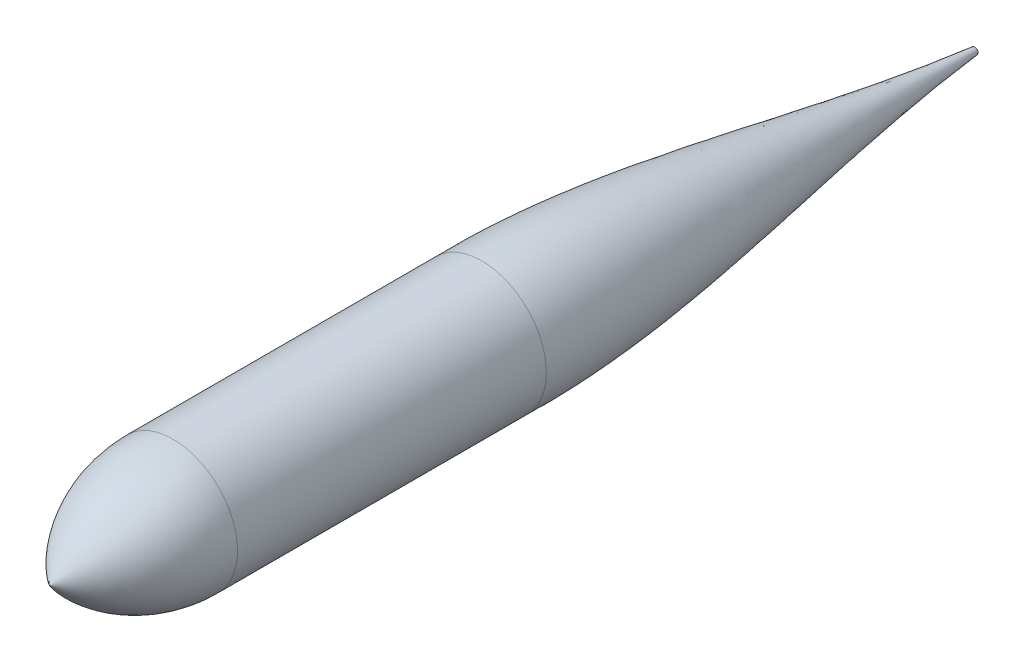
ISO-10303-21;
HEADER;
FILE_DESCRIPTION(('STEP AP214'),'2;1');
FILE_NAME('part.step','',(''),(''),'','','');
FILE_SCHEMA(('AUTOMOTIVE_DESIGN { 1 0 10303 214 1 1 1 1 }'));
ENDSEC;
DATA;
#1=APPLICATION_CONTEXT('core data for automotive mechanical design processes');
#2=APPLICATION_PROTOCOL_DEFINITION('international standard','automotive_design',2000,#1);
#3=PRODUCT_CONTEXT('',#1,'mechanical');
#4=PRODUCT('Part','Part','',(#3));
#5=PRODUCT_RELATED_PRODUCT_CATEGORY('part','',(#4));
#6=PRODUCT_DEFINITION_FORMATION('','',#4);
#7=PRODUCT_DEFINITION_CONTEXT('part definition',#1,'design');
#8=PRODUCT_DEFINITION('design','',#6,#7);
#9=PRODUCT_DEFINITION_SHAPE('','',#8);
#10=(LENGTH_UNIT() NAMED_UNIT(*) SI_UNIT(.MILLI.,.METRE.));
#11=(NAMED_UNIT(*) PLANE_ANGLE_UNIT() SI_UNIT($,.RADIAN.));
#12=(NAMED_UNIT(*) SI_UNIT($,.STERADIAN.) SOLID_ANGLE_UNIT());
#13=UNCERTAINTY_MEASURE_WITH_UNIT(LENGTH_MEASURE(1.E-05),#10,'distance_accuracy_value','');
#14=(GEOMETRIC_REPRESENTATION_CONTEXT(3) GLOBAL_UNCERTAINTY_ASSIGNED_CONTEXT((#13)) GLOBAL_UNIT_ASSIGNED_CONTEXT((#10,
#11,#12)) REPRESENTATION_CONTEXT('',''));
#15=CARTESIAN_POINT('',(0.,0.,0.));
#16=DIRECTION('',(0.,0.,1.));
#17=DIRECTION('',(1.,0.,0.));
#18=AXIS2_PLACEMENT_3D('',#15,#16,#17);
#19=CARTESIAN_POINT('',(0.,2.22918957669888,-371.204839927709));
#20=DIRECTION('',(0.,0.,1.));
#21=DIRECTION('',(1.,0.,0.));
#22=AXIS2_PLACEMENT_3D('',#19,#20,#21);
#23=PLANE('',#22);
#24=CARTESIAN_POINT('',(0.,0.,-371.204839927709));
#25=DIRECTION('',(0.,0.,1.));
#26=DIRECTION('',(1.,0.,0.));
#27=AXIS2_PLACEMENT_3D('',#24,#25,#26);
#28=CIRCLE('',#27,2.22918957669888);
#29=CARTESIAN_POINT('',(2.22918957669888,0.,-371.204839927709));
#30=VERTEX_POINT('',#29);
#31=EDGE_CURVE('E11',#30,#30,#28,.T.);
#32=ORIENTED_EDGE('',*,*,#31,.F.);
#33=EDGE_LOOP('',(#32));
#34=FACE_BOUND('',#33,.T.);
#35=ADVANCED_FACE('F35',(#34),#23,.F.);
#36=CARTESIAN_POINT('',(0.,2.22918957669888,-371.204839927709));
#37=CARTESIAN_POINT('',(0.,3.30674614980165,-360.102334281935));
#38=CARTESIAN_POINT('',(0.,16.1143674246605,-250.562441163576));
#39=CARTESIAN_POINT('',(0.,44.6192571568311,-143.049498421442));
#40=CARTESIAN_POINT('',(0.,42.9626822832052,-42.9866578125162));
#41=B_SPLINE_CURVE_WITH_KNOTS('',3,(#36,#37,#38,#39,#40),.UNSPECIFIED.,.F.,.F.,(4,1,4),(0.,
0.0931550195769171,0.921405591511497),.UNSPECIFIED.);
#42=CARTESIAN_POINT('',(0.,0.,-0.756605105777908));
#43=DIRECTION('',(0.,0.,1.));
#44=AXIS1_PLACEMENT('',#42,#43);
#45=SURFACE_OF_REVOLUTION('',#41,#44);
#46=CARTESIAN_POINT('',(0.,0.,-42.9866578125162));
#47=DIRECTION('',(0.,0.,1.));
#48=DIRECTION('',(1.,0.,0.));
#49=AXIS2_PLACEMENT_3D('',#46,#47,#48);
#50=CIRCLE('',#49,42.9626822832052);
#51=CARTESIAN_POINT('',(42.9626822832052,0.,-42.9866578125162));
#52=VERTEX_POINT('',#51);
#53=EDGE_CURVE('E41',#52,#52,#50,.T.);
#54=ORIENTED_EDGE('',*,*,#53,.F.);
#55=EDGE_LOOP('',(#54));
#56=FACE_BOUND('',#55,.T.);
#57=ORIENTED_EDGE('',*,*,#31,.T.);
#58=EDGE_LOOP('',(#57));
#59=FACE_BOUND('',#58,.T.);
#60=ADVANCED_FACE('F62',(#56,#59),#45,.T.);
#61=CARTESIAN_POINT('',(0.,0.,-0.756605105777908));
#62=DIRECTION('',(0.,0.,1.));
#63=DIRECTION('',(1.,0.,0.));
#64=AXIS2_PLACEMENT_3D('',#61,#62,#63);
#65=CYLINDRICAL_SURFACE('',#64,42.9626822832052);
#66=CARTESIAN_POINT('',(0.,0.,162.684372695853));
#67=DIRECTION('',(0.,0.,1.));
#68=DIRECTION('',(1.,0.,0.));
#69=AXIS2_PLACEMENT_3D('',#66,#67,#68);
#70=CIRCLE('',#69,42.9626822832052);
#71=CARTESIAN_POINT('',(42.9626822832052,0.,162.684372695853));
#72=VERTEX_POINT('',#71);
#73=EDGE_CURVE('E51',#72,#72,#70,.T.);
#74=ORIENTED_EDGE('',*,*,#73,.F.);
#75=EDGE_LOOP('',(#74));
#76=FACE_BOUND('',#75,.T.);
#77=ORIENTED_EDGE('',*,*,#53,.T.);
#78=EDGE_LOOP('',(#77));
#79=FACE_BOUND('',#78,.T.);
#80=ADVANCED_FACE('F47',(#76,#79),#65,.T.);
#81=CARTESIAN_POINT('',(-57.7185947937897,0.,162.684372695853));
#82=DIRECTION('',(0.,-1.,0.));
#83=DIRECTION('',(1.,0.,0.));
#84=AXIS2_PLACEMENT_3D('',#81,#82,#83);
#85=CIRCLE('',#84,100.681277076995);
#86=TRIMMED_CURVE('',#85,(PARAMETER_VALUE(-0.960292533539393)),
(PARAMETER_VALUE(0.960292533539393)),.T.,.PARAMETER.);
#87=CARTESIAN_POINT('',(0.,0.,162.684372695853));
#88=DIRECTION('',(0.,0.,1.));
#89=AXIS1_PLACEMENT('',#87,#88);
#90=SURFACE_OF_REVOLUTION('',#86,#89);
#91=CARTESIAN_POINT('',(0.,0.,245.178514117441));
#92=VERTEX_POINT('',#91);
#93=VERTEX_LOOP('',#92);
#94=FACE_BOUND('',#93,.T.);
#95=ORIENTED_EDGE('',*,*,#73,.T.);
#96=EDGE_LOOP('',(#95));
#97=FACE_BOUND('',#96,.T.);
#98=ADVANCED_FACE('F44',(#94,#97),#90,.T.);
#99=CLOSED_SHELL('',(#35,#60,#80,#98));
#100=MANIFOLD_SOLID_BREP('B2',#99);
#101=ADVANCED_BREP_SHAPE_REPRESENTATION('',(#18,#100),#14);
#102=SHAPE_DEFINITION_REPRESENTATION(#9,#101);
ENDSEC;
END-ISO-10303-21;
